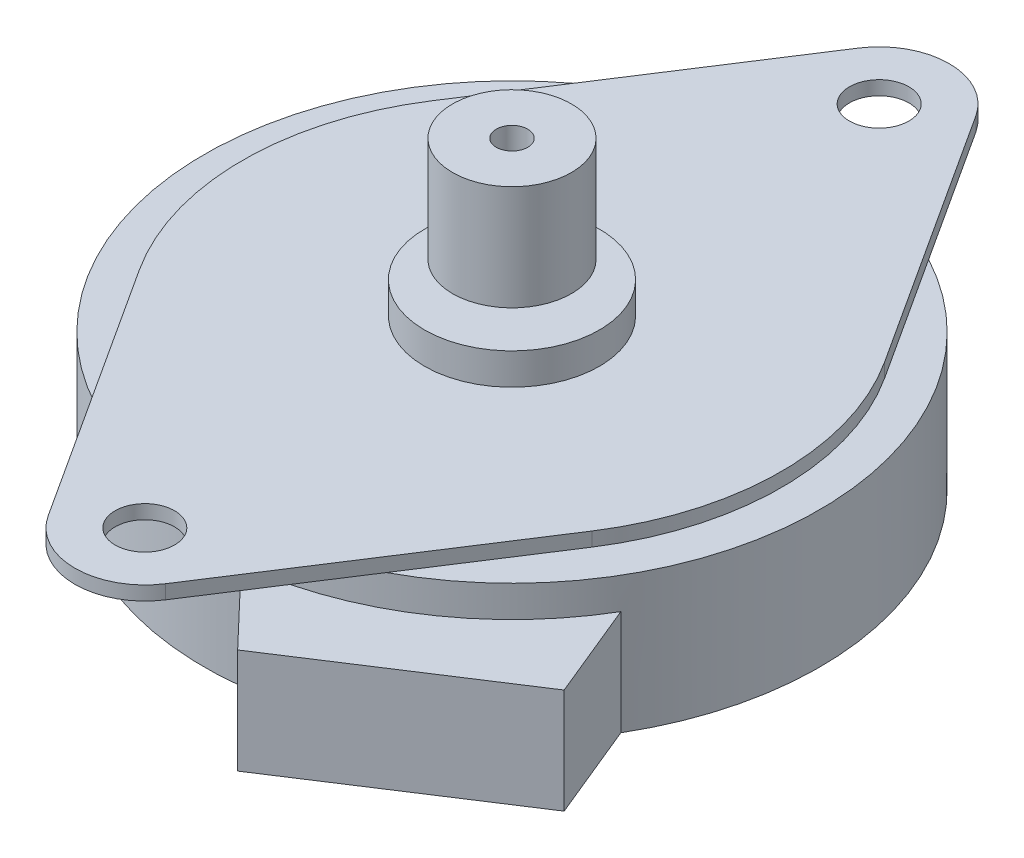
ISO-10303-21;
HEADER;
FILE_DESCRIPTION(('STEP AP214'),'2;1');
FILE_NAME('part.step','',(''),(''),'','','');
FILE_SCHEMA(('AUTOMOTIVE_DESIGN { 1 0 10303 214 1 1 1 1 }'));
ENDSEC;
DATA;
#1=APPLICATION_CONTEXT('core data for automotive mechanical design processes');
#2=APPLICATION_PROTOCOL_DEFINITION('international standard','automotive_design',2000,#1);
#3=PRODUCT_CONTEXT('',#1,'mechanical');
#4=PRODUCT('Part','Part','',(#3));
#5=PRODUCT_RELATED_PRODUCT_CATEGORY('part','',(#4));
#6=PRODUCT_DEFINITION_FORMATION('','',#4);
#7=PRODUCT_DEFINITION_CONTEXT('part definition',#1,'design');
#8=PRODUCT_DEFINITION('design','',#6,#7);
#9=PRODUCT_DEFINITION_SHAPE('','',#8);
#10=(LENGTH_UNIT() NAMED_UNIT(*) SI_UNIT(.MILLI.,.METRE.));
#11=(NAMED_UNIT(*) PLANE_ANGLE_UNIT() SI_UNIT($,.RADIAN.));
#12=(NAMED_UNIT(*) SI_UNIT($,.STERADIAN.) SOLID_ANGLE_UNIT());
#13=UNCERTAINTY_MEASURE_WITH_UNIT(LENGTH_MEASURE(1.E-05),#10,'distance_accuracy_value','');
#14=(GEOMETRIC_REPRESENTATION_CONTEXT(3) GLOBAL_UNCERTAINTY_ASSIGNED_CONTEXT((#13)) GLOBAL_UNIT_ASSIGNED_CONTEXT((#10,
#11,#12)) REPRESENTATION_CONTEXT('',''));
#15=CARTESIAN_POINT('',(0.,0.,0.));
#16=DIRECTION('',(0.,0.,1.));
#17=DIRECTION('',(1.,0.,0.));
#18=AXIS2_PLACEMENT_3D('',#15,#16,#17);
#19=CARTESIAN_POINT('',(0.,15.4,0.));
#20=DIRECTION('',(0.,-1.,0.));
#21=DIRECTION('',(0.,0.,-1.));
#22=AXIS2_PLACEMENT_3D('',#19,#20,#21);
#23=CYLINDRICAL_SURFACE('',#22,0.9);
#24=CARTESIAN_POINT('',(0.,10.4,0.));
#25=DIRECTION('',(0.,1.,0.));
#26=DIRECTION('',(0.,0.,1.));
#27=AXIS2_PLACEMENT_3D('',#24,#25,#26);
#28=CIRCLE('',#27,0.9);
#29=CARTESIAN_POINT('',(0.,10.4,0.9));
#30=VERTEX_POINT('',#29);
#31=EDGE_CURVE('E185',#30,#30,#28,.T.);
#32=ORIENTED_EDGE('',*,*,#31,.T.);
#33=EDGE_LOOP('',(#32));
#34=FACE_BOUND('',#33,.T.);
#35=CARTESIAN_POINT('',(0.,11.4,0.));
#36=DIRECTION('',(0.,1.,0.));
#37=DIRECTION('',(0.,0.,1.));
#38=AXIS2_PLACEMENT_3D('',#35,#36,#37);
#39=CIRCLE('',#38,0.9);
#40=CARTESIAN_POINT('',(0.,11.4,0.9));
#41=VERTEX_POINT('',#40);
#42=EDGE_CURVE('E11',#41,#41,#39,.T.);
#43=ORIENTED_EDGE('',*,*,#42,.F.);
#44=EDGE_LOOP('',(#43));
#45=FACE_BOUND('',#44,.T.);
#46=ADVANCED_FACE('F42',(#34,#45),#23,.T.);
#47=CARTESIAN_POINT('',(0.,7.8,0.));
#48=DIRECTION('',(0.,1.,0.));
#49=DIRECTION('',(0.,0.,1.));
#50=AXIS2_PLACEMENT_3D('',#47,#48,#49);
#51=PLANE('',#50);
#52=DIRECTION('',(0.543434343434261,0.,0.839451674830763));
#53=VECTOR('',#52,1.);
#54=CARTESIAN_POINT('',(-3.35780669932512,7.8,23.173737373737));
#55=LINE('',#54,#53);
#56=CARTESIAN_POINT('',(-12.9377309642099,7.8,8.37547597183833));
#57=VERTEX_POINT('',#56);
#58=CARTESIAN_POINT('',(-8.31928969295883,7.8,15.5096556700859));
#59=VERTEX_POINT('',#58);
#60=EDGE_CURVE('E241',#57,#59,#55,.T.);
#61=ORIENTED_EDGE('',*,*,#60,.F.);
#62=CARTESIAN_POINT('',(0.,7.8,0.));
#63=DIRECTION('',(0.,1.,0.));
#64=DIRECTION('',(0.,0.,1.));
#65=AXIS2_PLACEMENT_3D('',#62,#63,#64);
#66=CIRCLE('',#65,15.4121212121212);
#67=CARTESIAN_POINT('',(-12.9377309642091,7.8,-8.37547597183961));
#68=VERTEX_POINT('',#67);
#69=EDGE_CURVE('E237',#68,#57,#66,.T.);
#70=ORIENTED_EDGE('',*,*,#69,.F.);
#71=DIRECTION('',(-0.543434343434343,0.,0.83945167483071));
#72=VECTOR('',#71,1.);
#73=CARTESIAN_POINT('',(-3.35780669932284,7.8,-23.1737373737374));
#74=LINE('',#73,#72);
#75=CARTESIAN_POINT('',(-8.31928969295731,7.8,-15.5096556700868));
#76=VERTEX_POINT('',#75);
#77=EDGE_CURVE('E188',#76,#68,#74,.T.);
#78=ORIENTED_EDGE('',*,*,#77,.F.);
#79=CARTESIAN_POINT('',(0.,7.8,0.));
#80=DIRECTION('',(0.,1.,0.));
#81=DIRECTION('',(0.,0.,1.));
#82=AXIS2_PLACEMENT_3D('',#79,#80,#81);
#83=CIRCLE('',#82,17.6);
#84=EDGE_CURVE('E277',#76,#59,#83,.T.);
#85=ORIENTED_EDGE('',*,*,#84,.T.);
#86=EDGE_LOOP('',(#61,#70,#78,#85));
#87=FACE_BOUND('',#86,.T.);
#88=ADVANCED_FACE('F310',(#87),#51,.T.);
#89=CARTESIAN_POINT('',(0.,7.8,0.));
#90=DIRECTION('',(0.,-1.,0.));
#91=DIRECTION('',(0.,0.,-1.));
#92=AXIS2_PLACEMENT_3D('',#89,#90,#91);
#93=CYLINDRICAL_SURFACE('',#92,17.6);
#94=CARTESIAN_POINT('',(0.,0.,0.));
#95=DIRECTION('',(0.,1.,0.));
#96=DIRECTION('',(0.,0.,1.));
#97=AXIS2_PLACEMENT_3D('',#94,#95,#96);
#98=CIRCLE('',#97,17.6);
#99=CARTESIAN_POINT('',(15.1619001052058,0.,8.93738133905859));
#100=VERTEX_POINT('',#99);
#101=CARTESIAN_POINT('',(1.99379120909403,0.,17.4867034233025));
#102=VERTEX_POINT('',#101);
#103=EDGE_CURVE('E272',#100,#102,#98,.T.);
#104=ORIENTED_EDGE('',*,*,#103,.T.);
#105=DIRECTION('',(0.,-1.,0.));
#106=VECTOR('',#105,1.);
#107=CARTESIAN_POINT('',(1.99379120909383,6.,17.4867034233023));
#108=LINE('',#107,#106);
#109=CARTESIAN_POINT('',(1.99379120909385,6.,17.4867034233025));
#110=VERTEX_POINT('',#109);
#111=EDGE_CURVE('E62',#110,#102,#108,.T.);
#112=ORIENTED_EDGE('',*,*,#111,.F.);
#113=CARTESIAN_POINT('',(0.,6.,-2.28983498828939E-13));
#114=DIRECTION('',(0.,1.,0.));
#115=DIRECTION('',(0.,0.,1.));
#116=AXIS2_PLACEMENT_3D('',#113,#114,#115);
#117=CIRCLE('',#116,17.6);
#118=CARTESIAN_POINT('',(15.161900105206,6.,8.93738133905871));
#119=VERTEX_POINT('',#118);
#120=EDGE_CURVE('E57',#110,#119,#117,.T.);
#121=ORIENTED_EDGE('',*,*,#120,.T.);
#122=DIRECTION('',(0.,-1.,0.));
#123=VECTOR('',#122,1.);
#124=CARTESIAN_POINT('',(15.1619001052058,6.,8.93738133905859));
#125=LINE('',#124,#123);
#126=EDGE_CURVE('E154',#119,#100,#125,.T.);
#127=ORIENTED_EDGE('',*,*,#126,.T.);
#128=EDGE_LOOP('',(#104,#112,#121,#127));
#129=FACE_BOUND('',#128,.T.);
#130=CARTESIAN_POINT('',(8.31928969295578,7.8,15.5096556700876));
#131=VERTEX_POINT('',#130);
#132=CARTESIAN_POINT('',(8.31928969295731,7.8,-15.5096556700868));
#133=VERTEX_POINT('',#132);
#134=EDGE_CURVE('E273',#131,#133,#83,.T.);
#135=ORIENTED_EDGE('',*,*,#134,.F.);
#136=EDGE_CURVE('E275',#59,#131,#83,.T.);
#137=ORIENTED_EDGE('',*,*,#136,.F.);
#138=ORIENTED_EDGE('',*,*,#84,.F.);
#139=EDGE_CURVE('E274',#133,#76,#83,.T.);
#140=ORIENTED_EDGE('',*,*,#139,.F.);
#141=EDGE_LOOP('',(#135,#137,#138,#140));
#142=FACE_BOUND('',#141,.T.);
#143=ADVANCED_FACE('F44',(#129,#142),#93,.T.);
#144=DIRECTION('',(0.543434343434426,0.,-0.839451674830657));
#145=VECTOR('',#144,1.);
#146=CARTESIAN_POINT('',(3.35780669932056,7.8,23.1737373737377));
#147=LINE('',#146,#145);
#148=CARTESIAN_POINT('',(12.9377309642082,7.8,8.37547597184088));
#149=VERTEX_POINT('',#148);
#150=EDGE_CURVE('E248',#131,#149,#147,.T.);
#151=ORIENTED_EDGE('',*,*,#150,.F.);
#152=ORIENTED_EDGE('',*,*,#134,.T.);
#153=DIRECTION('',(-0.543434343434344,0.,-0.83945167483071));
#154=VECTOR('',#153,1.);
#155=CARTESIAN_POINT('',(3.35780669932284,7.8,-23.1737373737374));
#156=LINE('',#155,#154);
#157=CARTESIAN_POINT('',(12.9377309642091,7.8,-8.37547597183961));
#158=VERTEX_POINT('',#157);
#159=EDGE_CURVE('E229',#158,#133,#156,.T.);
#160=ORIENTED_EDGE('',*,*,#159,.F.);
#161=CARTESIAN_POINT('',(0.,7.8,0.));
#162=DIRECTION('',(0.,1.,0.));
#163=DIRECTION('',(0.,0.,1.));
#164=AXIS2_PLACEMENT_3D('',#161,#162,#163);
#165=CIRCLE('',#164,15.4121212121212);
#166=EDGE_CURVE('E204',#149,#158,#165,.T.);
#167=ORIENTED_EDGE('',*,*,#166,.F.);
#168=EDGE_LOOP('',(#151,#152,#160,#167));
#169=FACE_BOUND('',#168,.T.);
#170=ADVANCED_FACE('F307',(#169),#51,.T.);
#171=CARTESIAN_POINT('',(0.,0.,0.));
#172=DIRECTION('',(0.,1.,0.));
#173=DIRECTION('',(0.,0.,1.));
#174=AXIS2_PLACEMENT_3D('',#171,#172,#173);
#175=PLANE('',#174);
#176=CARTESIAN_POINT('',(0.,0.,0.));
#177=DIRECTION('',(0.,-1.,0.));
#178=DIRECTION('',(0.,0.,-1.));
#179=AXIS2_PLACEMENT_3D('',#176,#177,#178);
#180=CIRCLE('',#179,2.6);
#181=CARTESIAN_POINT('',(0.,0.,-2.6));
#182=VERTEX_POINT('',#181);
#183=EDGE_CURVE('E50',#182,#182,#180,.T.);
#184=ORIENTED_EDGE('',*,*,#183,.F.);
#185=EDGE_LOOP('',(#184));
#186=FACE_BOUND('',#185,.T.);
#187=ORIENTED_EDGE('',*,*,#103,.F.);
#188=DIRECTION('',(0.380101503379585,0.,0.924944780583457));
#189=VECTOR('',#188,1.);
#190=CARTESIAN_POINT('',(17.4235727432113,0.,14.4409699418707));
#191=LINE('',#190,#189);
#192=CARTESIAN_POINT('',(17.4235727432113,0.,14.4409699418707));
#193=VERTEX_POINT('',#192);
#194=EDGE_CURVE('E170',#100,#193,#191,.T.);
#195=ORIENTED_EDGE('',*,*,#194,.T.);
#196=DIRECTION('',(-0.838733050707768,0.,0.544542807913612));
#197=VECTOR('',#196,1.);
#198=CARTESIAN_POINT('',(6.10067655865646,0.,21.7922978487045));
#199=LINE('',#198,#197);
#200=CARTESIAN_POINT('',(6.10067655865646,0.,21.7922978487045));
#201=VERTEX_POINT('',#200);
#202=EDGE_CURVE('E148',#193,#201,#199,.T.);
#203=ORIENTED_EDGE('',*,*,#202,.T.);
#204=DIRECTION('',(-0.690211867687866,0.,-0.723607336683942));
#205=VECTOR('',#204,1.);
#206=CARTESIAN_POINT('',(6.10067655865646,0.,21.7922978487045));
#207=LINE('',#206,#205);
#208=EDGE_CURVE('E165',#201,#102,#207,.T.);
#209=ORIENTED_EDGE('',*,*,#208,.T.);
#210=EDGE_LOOP('',(#187,#195,#203,#209));
#211=FACE_BOUND('',#210,.T.);
#212=ADVANCED_FACE('F315',(#186,#211),#175,.F.);
#213=CARTESIAN_POINT('',(0.,7.8,0.));
#214=DIRECTION('',(0.,1.,0.));
#215=DIRECTION('',(0.,0.,1.));
#216=AXIS2_PLACEMENT_3D('',#213,#214,#215);
#217=PLANE('',#216);
#218=CARTESIAN_POINT('',(0.,7.8,-21.));
#219=DIRECTION('',(0.,1.,0.));
#220=DIRECTION('',(0.,0.,1.));
#221=AXIS2_PLACEMENT_3D('',#218,#219,#220);
#222=CIRCLE('',#221,1.7);
#223=CARTESIAN_POINT('',(0.,7.8,-19.3));
#224=VERTEX_POINT('',#223);
#225=EDGE_CURVE('E198',#224,#224,#222,.T.);
#226=ORIENTED_EDGE('',*,*,#225,.T.);
#227=EDGE_LOOP('',(#226));
#228=FACE_BOUND('',#227,.T.);
#229=CARTESIAN_POINT('',(3.35780669932284,7.8,-23.1737373737374));
#230=VERTEX_POINT('',#229);
#231=EDGE_CURVE('E228',#133,#230,#156,.T.);
#232=ORIENTED_EDGE('',*,*,#231,.F.);
#233=ORIENTED_EDGE('',*,*,#139,.T.);
#234=CARTESIAN_POINT('',(-3.35780669932284,7.8,-23.1737373737374));
#235=VERTEX_POINT('',#234);
#236=EDGE_CURVE('E234',#235,#76,#74,.T.);
#237=ORIENTED_EDGE('',*,*,#236,.F.);
#238=CARTESIAN_POINT('',(0.,7.8,-21.));
#239=DIRECTION('',(0.,1.,0.));
#240=DIRECTION('',(0.,0.,1.));
#241=AXIS2_PLACEMENT_3D('',#238,#239,#240);
#242=CIRCLE('',#241,4.);
#243=EDGE_CURVE('E232',#230,#235,#242,.T.);
#244=ORIENTED_EDGE('',*,*,#243,.F.);
#245=EDGE_LOOP('',(#232,#233,#237,#244));
#246=FACE_BOUND('',#245,.T.);
#247=ADVANCED_FACE('F289',(#228,#246),#217,.F.);
#248=CARTESIAN_POINT('',(-2.06334560000726E-12,7.8,21.));
#249=DIRECTION('',(0.,1.,0.));
#250=DIRECTION('',(0.,0.,1.));
#251=AXIS2_PLACEMENT_3D('',#248,#249,#250);
#252=CIRCLE('',#251,1.7);
#253=CARTESIAN_POINT('',(-2.06334560000726E-12,7.8,22.7));
#254=VERTEX_POINT('',#253);
#255=EDGE_CURVE('E192',#254,#254,#252,.T.);
#256=ORIENTED_EDGE('',*,*,#255,.T.);
#257=EDGE_LOOP('',(#256));
#258=FACE_BOUND('',#257,.T.);
#259=CARTESIAN_POINT('',(-3.35780669932512,7.8,23.173737373737));
#260=VERTEX_POINT('',#259);
#261=EDGE_CURVE('E240',#59,#260,#55,.T.);
#262=ORIENTED_EDGE('',*,*,#261,.F.);
#263=ORIENTED_EDGE('',*,*,#136,.T.);
#264=CARTESIAN_POINT('',(3.35780669932056,7.8,23.1737373737377));
#265=VERTEX_POINT('',#264);
#266=EDGE_CURVE('E211',#265,#131,#147,.T.);
#267=ORIENTED_EDGE('',*,*,#266,.F.);
#268=CARTESIAN_POINT('',(-2.06334560000726E-12,7.8,21.));
#269=DIRECTION('',(0.,1.,0.));
#270=DIRECTION('',(0.,0.,1.));
#271=AXIS2_PLACEMENT_3D('',#268,#269,#270);
#272=CIRCLE('',#271,4.);
#273=EDGE_CURVE('E244',#260,#265,#272,.T.);
#274=ORIENTED_EDGE('',*,*,#273,.F.);
#275=EDGE_LOOP('',(#262,#263,#267,#274));
#276=FACE_BOUND('',#275,.T.);
#277=ADVANCED_FACE('F349',(#258,#276),#217,.F.);
#278=CARTESIAN_POINT('',(0.,8.6,0.));
#279=DIRECTION('',(0.,1.,0.));
#280=DIRECTION('',(0.,0.,1.));
#281=AXIS2_PLACEMENT_3D('',#278,#279,#280);
#282=PLANE('',#281);
#283=CARTESIAN_POINT('',(0.,8.6,0.));
#284=DIRECTION('',(0.,1.,0.));
#285=DIRECTION('',(0.,0.,1.));
#286=AXIS2_PLACEMENT_3D('',#283,#284,#285);
#287=CIRCLE('',#286,5.);
#288=CARTESIAN_POINT('',(0.,8.6,5.));
#289=VERTEX_POINT('',#288);
#290=EDGE_CURVE('E182',#289,#289,#287,.T.);
#291=ORIENTED_EDGE('',*,*,#290,.F.);
#292=EDGE_LOOP('',(#291));
#293=FACE_BOUND('',#292,.T.);
#294=CARTESIAN_POINT('',(0.,8.6,-21.));
#295=DIRECTION('',(0.,1.,0.));
#296=DIRECTION('',(0.,0.,1.));
#297=AXIS2_PLACEMENT_3D('',#294,#295,#296);
#298=CIRCLE('',#297,1.7);
#299=CARTESIAN_POINT('',(0.,8.6,-19.3));
#300=VERTEX_POINT('',#299);
#301=EDGE_CURVE('E201',#300,#300,#298,.T.);
#302=ORIENTED_EDGE('',*,*,#301,.F.);
#303=EDGE_LOOP('',(#302));
#304=FACE_BOUND('',#303,.T.);
#305=CARTESIAN_POINT('',(0.,8.6,0.));
#306=DIRECTION('',(0.,1.,0.));
#307=DIRECTION('',(0.,0.,1.));
#308=AXIS2_PLACEMENT_3D('',#305,#306,#307);
#309=CIRCLE('',#308,15.4121212121212);
#310=CARTESIAN_POINT('',(12.9377309642082,8.6,8.37547597184088));
#311=VERTEX_POINT('',#310);
#312=CARTESIAN_POINT('',(12.9377309642091,8.6,-8.37547597183961));
#313=VERTEX_POINT('',#312);
#314=EDGE_CURVE('E207',#311,#313,#309,.T.);
#315=ORIENTED_EDGE('',*,*,#314,.T.);
#316=DIRECTION('',(-0.543434343434344,0.,-0.83945167483071));
#317=VECTOR('',#316,1.);
#318=CARTESIAN_POINT('',(3.35780669932284,8.6,-23.1737373737374));
#319=LINE('',#318,#317);
#320=CARTESIAN_POINT('',(3.35780669932284,8.6,-23.1737373737374));
#321=VERTEX_POINT('',#320);
#322=EDGE_CURVE('E210',#313,#321,#319,.T.);
#323=ORIENTED_EDGE('',*,*,#322,.T.);
#324=CARTESIAN_POINT('',(0.,8.6,-21.));
#325=DIRECTION('',(0.,1.,0.));
#326=DIRECTION('',(0.,0.,1.));
#327=AXIS2_PLACEMENT_3D('',#324,#325,#326);
#328=CIRCLE('',#327,4.);
#329=CARTESIAN_POINT('',(-3.35780669932284,8.6,-23.1737373737374));
#330=VERTEX_POINT('',#329);
#331=EDGE_CURVE('E213',#321,#330,#328,.T.);
#332=ORIENTED_EDGE('',*,*,#331,.T.);
#333=DIRECTION('',(-0.543434343434343,0.,0.83945167483071));
#334=VECTOR('',#333,1.);
#335=CARTESIAN_POINT('',(-3.35780669932284,8.6,-23.1737373737374));
#336=LINE('',#335,#334);
#337=CARTESIAN_POINT('',(-12.9377309642091,8.6,-8.37547597183961));
#338=VERTEX_POINT('',#337);
#339=EDGE_CURVE('E215',#330,#338,#336,.T.);
#340=ORIENTED_EDGE('',*,*,#339,.T.);
#341=CARTESIAN_POINT('',(0.,8.6,0.));
#342=DIRECTION('',(0.,1.,0.));
#343=DIRECTION('',(0.,0.,1.));
#344=AXIS2_PLACEMENT_3D('',#341,#342,#343);
#345=CIRCLE('',#344,15.4121212121212);
#346=CARTESIAN_POINT('',(-12.9377309642099,8.6,8.37547597183833));
#347=VERTEX_POINT('',#346);
#348=EDGE_CURVE('E217',#338,#347,#345,.T.);
#349=ORIENTED_EDGE('',*,*,#348,.T.);
#350=DIRECTION('',(0.543434343434261,0.,0.839451674830763));
#351=VECTOR('',#350,1.);
#352=CARTESIAN_POINT('',(-3.35780669932512,8.6,23.173737373737));
#353=LINE('',#352,#351);
#354=CARTESIAN_POINT('',(-3.35780669932512,8.6,23.173737373737));
#355=VERTEX_POINT('',#354);
#356=EDGE_CURVE('E219',#347,#355,#353,.T.);
#357=ORIENTED_EDGE('',*,*,#356,.T.);
#358=CARTESIAN_POINT('',(-2.06334560000726E-12,8.6,21.));
#359=DIRECTION('',(0.,1.,0.));
#360=DIRECTION('',(0.,0.,1.));
#361=AXIS2_PLACEMENT_3D('',#358,#359,#360);
#362=CIRCLE('',#361,4.);
#363=CARTESIAN_POINT('',(3.35780669932056,8.6,23.1737373737377));
#364=VERTEX_POINT('',#363);
#365=EDGE_CURVE('E221',#355,#364,#362,.T.);
#366=ORIENTED_EDGE('',*,*,#365,.T.);
#367=DIRECTION('',(0.543434343434426,0.,-0.839451674830657));
#368=VECTOR('',#367,1.);
#369=CARTESIAN_POINT('',(3.35780669932056,8.6,23.1737373737377));
#370=LINE('',#369,#368);
#371=EDGE_CURVE('E223',#364,#311,#370,.T.);
#372=ORIENTED_EDGE('',*,*,#371,.T.);
#373=EDGE_LOOP('',(#315,#323,#332,#340,#349,#357,#366,#372));
#374=FACE_BOUND('',#373,.T.);
#375=CARTESIAN_POINT('',(-2.06334560000726E-12,8.6,21.));
#376=DIRECTION('',(0.,1.,0.));
#377=DIRECTION('',(0.,0.,1.));
#378=AXIS2_PLACEMENT_3D('',#375,#376,#377);
#379=CIRCLE('',#378,1.7);
#380=CARTESIAN_POINT('',(-2.06334560000726E-12,8.6,22.7));
#381=VERTEX_POINT('',#380);
#382=EDGE_CURVE('E195',#381,#381,#379,.T.);
#383=ORIENTED_EDGE('',*,*,#382,.F.);
#384=EDGE_LOOP('',(#383));
#385=FACE_BOUND('',#384,.T.);
#386=ADVANCED_FACE('F345',(#293,#304,#374,#385),#282,.T.);
#387=CARTESIAN_POINT('',(0.,8.6,0.));
#388=DIRECTION('',(0.,-1.,0.));
#389=DIRECTION('',(0.,0.,-1.));
#390=AXIS2_PLACEMENT_3D('',#387,#388,#389);
#391=CYLINDRICAL_SURFACE('',#390,15.4121212121212);
#392=ORIENTED_EDGE('',*,*,#166,.T.);
#393=DIRECTION('',(0.,-1.,0.));
#394=VECTOR('',#393,1.);
#395=CARTESIAN_POINT('',(12.9377309642091,8.6,-8.37547597183961));
#396=LINE('',#395,#394);
#397=EDGE_CURVE('E269',#313,#158,#396,.T.);
#398=ORIENTED_EDGE('',*,*,#397,.F.);
#399=ORIENTED_EDGE('',*,*,#314,.F.);
#400=DIRECTION('',(0.,-1.,0.));
#401=VECTOR('',#400,1.);
#402=CARTESIAN_POINT('',(12.9377309642082,8.6,8.37547597184088));
#403=LINE('',#402,#401);
#404=EDGE_CURVE('E225',#311,#149,#403,.T.);
#405=ORIENTED_EDGE('',*,*,#404,.T.);
#406=EDGE_LOOP('',(#392,#398,#399,#405));
#407=FACE_BOUND('',#406,.T.);
#408=ADVANCED_FACE('F348',(#407),#391,.T.);
#409=CARTESIAN_POINT('',(3.35780669932284,8.6,-23.1737373737374));
#410=DIRECTION('',(-0.83945167483071,0.,0.543434343434344));
#411=DIRECTION('',(0.543434343434344,0.,0.83945167483071));
#412=AXIS2_PLACEMENT_3D('',#409,#410,#411);
#413=PLANE('',#412);
#414=ORIENTED_EDGE('',*,*,#159,.T.);
#415=ORIENTED_EDGE('',*,*,#231,.T.);
#416=DIRECTION('',(0.,-1.,0.));
#417=VECTOR('',#416,1.);
#418=CARTESIAN_POINT('',(3.35780669932284,8.6,-23.1737373737374));
#419=LINE('',#418,#417);
#420=EDGE_CURVE('E266',#321,#230,#419,.T.);
#421=ORIENTED_EDGE('',*,*,#420,.F.);
#422=ORIENTED_EDGE('',*,*,#322,.F.);
#423=ORIENTED_EDGE('',*,*,#397,.T.);
#424=EDGE_LOOP('',(#414,#415,#421,#422,#423));
#425=FACE_BOUND('',#424,.T.);
#426=ADVANCED_FACE('F304',(#425),#413,.F.);
#427=CARTESIAN_POINT('',(0.,8.6,-21.));
#428=DIRECTION('',(0.,-1.,0.));
#429=DIRECTION('',(0.,0.,-1.));
#430=AXIS2_PLACEMENT_3D('',#427,#428,#429);
#431=CYLINDRICAL_SURFACE('',#430,4.);
#432=ORIENTED_EDGE('',*,*,#243,.T.);
#433=DIRECTION('',(0.,-1.,0.));
#434=VECTOR('',#433,1.);
#435=CARTESIAN_POINT('',(-3.35780669932284,8.6,-23.1737373737374));
#436=LINE('',#435,#434);
#437=EDGE_CURVE('E263',#330,#235,#436,.T.);
#438=ORIENTED_EDGE('',*,*,#437,.F.);
#439=ORIENTED_EDGE('',*,*,#331,.F.);
#440=ORIENTED_EDGE('',*,*,#420,.T.);
#441=EDGE_LOOP('',(#432,#438,#439,#440));
#442=FACE_BOUND('',#441,.T.);
#443=ADVANCED_FACE('F301',(#442),#431,.T.);
#444=CARTESIAN_POINT('',(-3.35780669932284,8.6,-23.1737373737374));
#445=DIRECTION('',(0.83945167483071,0.,0.543434343434343));
#446=DIRECTION('',(0.543434343434343,0.,-0.83945167483071));
#447=AXIS2_PLACEMENT_3D('',#444,#445,#446);
#448=PLANE('',#447);
#449=ORIENTED_EDGE('',*,*,#236,.T.);
#450=ORIENTED_EDGE('',*,*,#77,.T.);
#451=DIRECTION('',(0.,-1.,0.));
#452=VECTOR('',#451,1.);
#453=CARTESIAN_POINT('',(-12.9377309642091,8.6,-8.37547597183961));
#454=LINE('',#453,#452);
#455=EDGE_CURVE('E260',#338,#68,#454,.T.);
#456=ORIENTED_EDGE('',*,*,#455,.F.);
#457=ORIENTED_EDGE('',*,*,#339,.F.);
#458=ORIENTED_EDGE('',*,*,#437,.T.);
#459=EDGE_LOOP('',(#449,#450,#456,#457,#458));
#460=FACE_BOUND('',#459,.T.);
#461=ADVANCED_FACE('F295',(#460),#448,.F.);
#462=CARTESIAN_POINT('',(0.,8.6,0.));
#463=DIRECTION('',(0.,-1.,0.));
#464=DIRECTION('',(0.,0.,-1.));
#465=AXIS2_PLACEMENT_3D('',#462,#463,#464);
#466=CYLINDRICAL_SURFACE('',#465,15.4121212121212);
#467=ORIENTED_EDGE('',*,*,#69,.T.);
#468=DIRECTION('',(0.,-1.,0.));
#469=VECTOR('',#468,1.);
#470=CARTESIAN_POINT('',(-12.9377309642099,8.6,8.37547597183833));
#471=LINE('',#470,#469);
#472=EDGE_CURVE('E257',#347,#57,#471,.T.);
#473=ORIENTED_EDGE('',*,*,#472,.F.);
#474=ORIENTED_EDGE('',*,*,#348,.F.);
#475=ORIENTED_EDGE('',*,*,#455,.T.);
#476=EDGE_LOOP('',(#467,#473,#474,#475));
#477=FACE_BOUND('',#476,.T.);
#478=ADVANCED_FACE('F364',(#477),#466,.T.);
#479=CARTESIAN_POINT('',(-3.35780669932512,8.6,23.173737373737));
#480=DIRECTION('',(0.839451674830763,0.,-0.543434343434261));
#481=DIRECTION('',(-0.543434343434261,0.,-0.839451674830763));
#482=AXIS2_PLACEMENT_3D('',#479,#480,#481);
#483=PLANE('',#482);
#484=ORIENTED_EDGE('',*,*,#60,.T.);
#485=ORIENTED_EDGE('',*,*,#261,.T.);
#486=DIRECTION('',(0.,-1.,0.));
#487=VECTOR('',#486,1.);
#488=CARTESIAN_POINT('',(-3.35780669932512,8.6,23.173737373737));
#489=LINE('',#488,#487);
#490=EDGE_CURVE('E254',#355,#260,#489,.T.);
#491=ORIENTED_EDGE('',*,*,#490,.F.);
#492=ORIENTED_EDGE('',*,*,#356,.F.);
#493=ORIENTED_EDGE('',*,*,#472,.T.);
#494=EDGE_LOOP('',(#484,#485,#491,#492,#493));
#495=FACE_BOUND('',#494,.T.);
#496=ADVANCED_FACE('F360',(#495),#483,.F.);
#497=CARTESIAN_POINT('',(-2.06334560000726E-12,8.6,21.));
#498=DIRECTION('',(0.,-1.,0.));
#499=DIRECTION('',(0.,0.,-1.));
#500=AXIS2_PLACEMENT_3D('',#497,#498,#499);
#501=CYLINDRICAL_SURFACE('',#500,4.);
#502=ORIENTED_EDGE('',*,*,#273,.T.);
#503=DIRECTION('',(0.,-1.,0.));
#504=VECTOR('',#503,1.);
#505=CARTESIAN_POINT('',(3.35780669932056,8.6,23.1737373737377));
#506=LINE('',#505,#504);
#507=EDGE_CURVE('E251',#364,#265,#506,.T.);
#508=ORIENTED_EDGE('',*,*,#507,.F.);
#509=ORIENTED_EDGE('',*,*,#365,.F.);
#510=ORIENTED_EDGE('',*,*,#490,.T.);
#511=EDGE_LOOP('',(#502,#508,#509,#510));
#512=FACE_BOUND('',#511,.T.);
#513=ADVANCED_FACE('F356',(#512),#501,.T.);
#514=CARTESIAN_POINT('',(3.35780669932056,8.6,23.1737373737377));
#515=DIRECTION('',(-0.839451674830657,0.,-0.543434343434426));
#516=DIRECTION('',(-0.543434343434426,0.,0.839451674830657));
#517=AXIS2_PLACEMENT_3D('',#514,#515,#516);
#518=PLANE('',#517);
#519=ORIENTED_EDGE('',*,*,#266,.T.);
#520=ORIENTED_EDGE('',*,*,#150,.T.);
#521=ORIENTED_EDGE('',*,*,#404,.F.);
#522=ORIENTED_EDGE('',*,*,#371,.F.);
#523=ORIENTED_EDGE('',*,*,#507,.T.);
#524=EDGE_LOOP('',(#519,#520,#521,#522,#523));
#525=FACE_BOUND('',#524,.T.);
#526=ADVANCED_FACE('F343',(#525),#518,.F.);
#527=CARTESIAN_POINT('',(0.,8.6,-21.));
#528=DIRECTION('',(0.,-1.,0.));
#529=DIRECTION('',(0.,0.,-1.));
#530=AXIS2_PLACEMENT_3D('',#527,#528,#529);
#531=CYLINDRICAL_SURFACE('',#530,1.7);
#532=ORIENTED_EDGE('',*,*,#301,.T.);
#533=EDGE_LOOP('',(#532));
#534=FACE_BOUND('',#533,.T.);
#535=ORIENTED_EDGE('',*,*,#225,.F.);
#536=EDGE_LOOP('',(#535));
#537=FACE_BOUND('',#536,.T.);
#538=ADVANCED_FACE('F339',(#534,#537),#531,.F.);
#539=CARTESIAN_POINT('',(-2.06334560000726E-12,8.6,21.));
#540=DIRECTION('',(0.,-1.,0.));
#541=DIRECTION('',(0.,0.,-1.));
#542=AXIS2_PLACEMENT_3D('',#539,#540,#541);
#543=CYLINDRICAL_SURFACE('',#542,1.7);
#544=ORIENTED_EDGE('',*,*,#382,.T.);
#545=EDGE_LOOP('',(#544));
#546=FACE_BOUND('',#545,.T.);
#547=ORIENTED_EDGE('',*,*,#255,.F.);
#548=EDGE_LOOP('',(#547));
#549=FACE_BOUND('',#548,.T.);
#550=ADVANCED_FACE('F335',(#546,#549),#543,.F.);
#551=CARTESIAN_POINT('',(0.,10.4,0.));
#552=DIRECTION('',(0.,-1.,0.));
#553=DIRECTION('',(0.,0.,-1.));
#554=AXIS2_PLACEMENT_3D('',#551,#552,#553);
#555=CYLINDRICAL_SURFACE('',#554,5.);
#556=CARTESIAN_POINT('',(0.,10.4,0.));
#557=DIRECTION('',(0.,1.,0.));
#558=DIRECTION('',(0.,0.,1.));
#559=AXIS2_PLACEMENT_3D('',#556,#557,#558);
#560=CIRCLE('',#559,5.);
#561=CARTESIAN_POINT('',(0.,10.4,5.));
#562=VERTEX_POINT('',#561);
#563=EDGE_CURVE('E189',#562,#562,#560,.T.);
#564=ORIENTED_EDGE('',*,*,#563,.F.);
#565=EDGE_LOOP('',(#564));
#566=FACE_BOUND('',#565,.T.);
#567=ORIENTED_EDGE('',*,*,#290,.T.);
#568=EDGE_LOOP('',(#567));
#569=FACE_BOUND('',#568,.T.);
#570=ADVANCED_FACE('F331',(#566,#569),#555,.T.);
#571=CARTESIAN_POINT('',(0.,10.4,0.));
#572=DIRECTION('',(0.,1.,0.));
#573=DIRECTION('',(0.,0.,1.));
#574=AXIS2_PLACEMENT_3D('',#571,#572,#573);
#575=PLANE('',#574);
#576=ORIENTED_EDGE('',*,*,#31,.F.);
#577=EDGE_LOOP('',(#576));
#578=FACE_BOUND('',#577,.T.);
#579=ORIENTED_EDGE('',*,*,#563,.T.);
#580=EDGE_LOOP('',(#579));
#581=FACE_BOUND('',#580,.T.);
#582=ADVANCED_FACE('F327',(#578,#581),#575,.T.);
#583=CARTESIAN_POINT('',(0.,-0.5,0.));
#584=DIRECTION('',(0.,1.,0.));
#585=DIRECTION('',(0.,0.,1.));
#586=AXIS2_PLACEMENT_3D('',#583,#584,#585);
#587=CYLINDRICAL_SURFACE('',#586,2.6);
#588=CARTESIAN_POINT('',(0.,-0.5,0.));
#589=DIRECTION('',(0.,-1.,0.));
#590=DIRECTION('',(0.,0.,-1.));
#591=AXIS2_PLACEMENT_3D('',#588,#589,#590);
#592=CIRCLE('',#591,2.6);
#593=CARTESIAN_POINT('',(0.,-0.5,-2.6));
#594=VERTEX_POINT('',#593);
#595=EDGE_CURVE('E177',#594,#594,#592,.T.);
#596=ORIENTED_EDGE('',*,*,#595,.F.);
#597=EDGE_LOOP('',(#596));
#598=FACE_BOUND('',#597,.T.);
#599=ORIENTED_EDGE('',*,*,#183,.T.);
#600=EDGE_LOOP('',(#599));
#601=FACE_BOUND('',#600,.T.);
#602=ADVANCED_FACE('F330',(#598,#601),#587,.T.);
#603=CARTESIAN_POINT('',(0.,-0.5,0.));
#604=DIRECTION('',(0.,-1.,0.));
#605=DIRECTION('',(0.,0.,-1.));
#606=AXIS2_PLACEMENT_3D('',#603,#604,#605);
#607=PLANE('',#606);
#608=ORIENTED_EDGE('',*,*,#595,.T.);
#609=EDGE_LOOP('',(#608));
#610=FACE_BOUND('',#609,.T.);
#611=ADVANCED_FACE('F387',(#610),#607,.T.);
#612=CARTESIAN_POINT('',(6.10067655865646,6.,21.7922978487045));
#613=DIRECTION('',(-0.723607336683942,0.,0.690211867687866));
#614=DIRECTION('',(0.690211867687866,0.,0.723607336683942));
#615=AXIS2_PLACEMENT_3D('',#612,#613,#614);
#616=PLANE('',#615);
#617=ORIENTED_EDGE('',*,*,#208,.F.);
#618=DIRECTION('',(0.,-1.,0.));
#619=VECTOR('',#618,1.);
#620=CARTESIAN_POINT('',(6.10067655865646,6.,21.7922978487045));
#621=LINE('',#620,#619);
#622=CARTESIAN_POINT('',(6.10067655865646,6.,21.7922978487045));
#623=VERTEX_POINT('',#622);
#624=EDGE_CURVE('E153',#623,#201,#621,.T.);
#625=ORIENTED_EDGE('',*,*,#624,.F.);
#626=DIRECTION('',(-0.690211867687866,0.,-0.723607336683942));
#627=VECTOR('',#626,1.);
#628=CARTESIAN_POINT('',(6.10067655865646,6.,21.7922978487045));
#629=LINE('',#628,#627);
#630=EDGE_CURVE('E161',#623,#110,#629,.T.);
#631=ORIENTED_EDGE('',*,*,#630,.T.);
#632=ORIENTED_EDGE('',*,*,#111,.T.);
#633=EDGE_LOOP('',(#617,#625,#631,#632));
#634=FACE_BOUND('',#633,.T.);
#635=ADVANCED_FACE('F385',(#634),#616,.T.);
#636=CARTESIAN_POINT('',(6.10067655865646,6.,21.7922978487045));
#637=DIRECTION('',(0.544542807913611,0.,0.838733050707768));
#638=DIRECTION('',(0.838733050707768,0.,-0.544542807913612));
#639=AXIS2_PLACEMENT_3D('',#636,#637,#638);
#640=PLANE('',#639);
#641=ORIENTED_EDGE('',*,*,#202,.F.);
#642=DIRECTION('',(0.,-1.,0.));
#643=VECTOR('',#642,1.);
#644=CARTESIAN_POINT('',(17.4235727432113,6.,14.4409699418707));
#645=LINE('',#644,#643);
#646=CARTESIAN_POINT('',(17.4235727432113,6.,14.4409699418707));
#647=VERTEX_POINT('',#646);
#648=EDGE_CURVE('E142',#647,#193,#645,.T.);
#649=ORIENTED_EDGE('',*,*,#648,.F.);
#650=DIRECTION('',(-0.838733050707768,0.,0.544542807913612));
#651=VECTOR('',#650,1.);
#652=CARTESIAN_POINT('',(6.10067655865646,6.,21.7922978487045));
#653=LINE('',#652,#651);
#654=EDGE_CURVE('E145',#647,#623,#653,.T.);
#655=ORIENTED_EDGE('',*,*,#654,.T.);
#656=ORIENTED_EDGE('',*,*,#624,.T.);
#657=EDGE_LOOP('',(#641,#649,#655,#656));
#658=FACE_BOUND('',#657,.T.);
#659=ADVANCED_FACE('F144',(#658),#640,.T.);
#660=CARTESIAN_POINT('',(17.4235727432113,6.,14.4409699418707));
#661=DIRECTION('',(0.924944780583457,0.,-0.380101503379585));
#662=DIRECTION('',(-0.380101503379585,0.,-0.924944780583457));
#663=AXIS2_PLACEMENT_3D('',#660,#661,#662);
#664=PLANE('',#663);
#665=ORIENTED_EDGE('',*,*,#194,.F.);
#666=ORIENTED_EDGE('',*,*,#126,.F.);
#667=DIRECTION('',(0.380101503379585,0.,0.924944780583457));
#668=VECTOR('',#667,1.);
#669=CARTESIAN_POINT('',(17.4235727432113,6.,14.4409699418707));
#670=LINE('',#669,#668);
#671=EDGE_CURVE('E159',#119,#647,#670,.T.);
#672=ORIENTED_EDGE('',*,*,#671,.T.);
#673=ORIENTED_EDGE('',*,*,#648,.T.);
#674=EDGE_LOOP('',(#665,#666,#672,#673));
#675=FACE_BOUND('',#674,.T.);
#676=ADVANCED_FACE('F163',(#675),#664,.T.);
#677=CARTESIAN_POINT('',(0.,6.,-2.28983498828939E-13));
#678=DIRECTION('',(0.,1.,0.));
#679=DIRECTION('',(0.,0.,1.));
#680=AXIS2_PLACEMENT_3D('',#677,#678,#679);
#681=PLANE('',#680);
#682=ORIENTED_EDGE('',*,*,#120,.F.);
#683=ORIENTED_EDGE('',*,*,#630,.F.);
#684=ORIENTED_EDGE('',*,*,#654,.F.);
#685=ORIENTED_EDGE('',*,*,#671,.F.);
#686=EDGE_LOOP('',(#682,#683,#684,#685));
#687=FACE_BOUND('',#686,.T.);
#688=ADVANCED_FACE('F158',(#687),#681,.T.);
#689=CARTESIAN_POINT('',(0.,17.4,0.));
#690=DIRECTION('',(0.,1.,0.));
#691=DIRECTION('',(0.,0.,1.));
#692=AXIS2_PLACEMENT_3D('',#689,#690,#691);
#693=PLANE('',#692);
#694=CARTESIAN_POINT('',(0.,17.4,0.));
#695=DIRECTION('',(0.,1.,0.));
#696=DIRECTION('',(0.,0.,1.));
#697=AXIS2_PLACEMENT_3D('',#694,#695,#696);
#698=CIRCLE('',#697,3.4);
#699=CARTESIAN_POINT('',(0.,17.4,3.4));
#700=VERTEX_POINT('',#699);
#701=EDGE_CURVE('E623',#700,#700,#698,.T.);
#702=ORIENTED_EDGE('',*,*,#701,.T.);
#703=EDGE_LOOP('',(#702));
#704=FACE_BOUND('',#703,.T.);
#705=CARTESIAN_POINT('',(0.,17.4,0.));
#706=DIRECTION('',(0.,1.,0.));
#707=DIRECTION('',(0.,0.,1.));
#708=AXIS2_PLACEMENT_3D('',#705,#706,#707);
#709=CIRCLE('',#708,0.9);
#710=CARTESIAN_POINT('',(0.,17.4,0.9));
#711=VERTEX_POINT('',#710);
#712=EDGE_CURVE('E629',#711,#711,#709,.T.);
#713=ORIENTED_EDGE('',*,*,#712,.F.);
#714=EDGE_LOOP('',(#713));
#715=FACE_BOUND('',#714,.T.);
#716=ADVANCED_FACE('F447',(#704,#715),#693,.T.);
#717=CARTESIAN_POINT('',(0.,11.4,0.));
#718=DIRECTION('',(0.,1.,0.));
#719=DIRECTION('',(0.,0.,1.));
#720=AXIS2_PLACEMENT_3D('',#717,#718,#719);
#721=PLANE('',#720);
#722=CARTESIAN_POINT('',(0.,11.4,0.));
#723=DIRECTION('',(0.,1.,0.));
#724=DIRECTION('',(0.,0.,1.));
#725=AXIS2_PLACEMENT_3D('',#722,#723,#724);
#726=CIRCLE('',#725,3.4);
#727=CARTESIAN_POINT('',(0.,11.4,3.4));
#728=VERTEX_POINT('',#727);
#729=EDGE_CURVE('E625',#728,#728,#726,.T.);
#730=ORIENTED_EDGE('',*,*,#729,.F.);
#731=EDGE_LOOP('',(#730));
#732=FACE_BOUND('',#731,.T.);
#733=ORIENTED_EDGE('',*,*,#42,.T.);
#734=EDGE_LOOP('',(#733));
#735=FACE_BOUND('',#734,.T.);
#736=ADVANCED_FACE('F460',(#732,#735),#721,.F.);
#737=CARTESIAN_POINT('',(0.,17.4,0.));
#738=DIRECTION('',(0.,-1.,0.));
#739=DIRECTION('',(0.,0.,-1.));
#740=AXIS2_PLACEMENT_3D('',#737,#738,#739);
#741=CYLINDRICAL_SURFACE('',#740,3.4);
#742=ORIENTED_EDGE('',*,*,#701,.F.);
#743=EDGE_LOOP('',(#742));
#744=FACE_BOUND('',#743,.T.);
#745=ORIENTED_EDGE('',*,*,#729,.T.);
#746=EDGE_LOOP('',(#745));
#747=FACE_BOUND('',#746,.T.);
#748=ADVANCED_FACE('F470',(#744,#747),#741,.T.);
#749=CARTESIAN_POINT('',(0.,17.4,0.));
#750=DIRECTION('',(0.,-1.,0.));
#751=DIRECTION('',(0.,0.,-1.));
#752=AXIS2_PLACEMENT_3D('',#749,#750,#751);
#753=CYLINDRICAL_SURFACE('',#752,0.9);
#754=CARTESIAN_POINT('',(0.,15.4,0.));
#755=DIRECTION('',(0.,1.,0.));
#756=DIRECTION('',(0.,0.,1.));
#757=AXIS2_PLACEMENT_3D('',#754,#755,#756);
#758=CIRCLE('',#757,0.9);
#759=CARTESIAN_POINT('',(0.,15.4,0.9));
#760=VERTEX_POINT('',#759);
#761=EDGE_CURVE('E172',#760,#760,#758,.F.);
#762=ORIENTED_EDGE('',*,*,#761,.T.);
#763=EDGE_LOOP('',(#762));
#764=FACE_BOUND('',#763,.T.);
#765=ORIENTED_EDGE('',*,*,#712,.T.);
#766=EDGE_LOOP('',(#765));
#767=FACE_BOUND('',#766,.T.);
#768=ADVANCED_FACE('F480',(#764,#767),#753,.F.);
#769=CARTESIAN_POINT('',(0.,15.4,0.));
#770=DIRECTION('',(0.,1.,0.));
#771=DIRECTION('',(0.,0.,1.));
#772=AXIS2_PLACEMENT_3D('',#769,#770,#771);
#773=PLANE('',#772);
#774=ORIENTED_EDGE('',*,*,#761,.F.);
#775=EDGE_LOOP('',(#774));
#776=FACE_BOUND('',#775,.T.);
#777=ADVANCED_FACE('F325',(#776),#773,.T.);
#778=CLOSED_SHELL('',(#46,#88,#143,#170,#212,#247,#277,#386,#408,#426,#443,#461,#478,#496,#513,
#526,#538,#550,#570,#582,#602,#611,#635,#659,#676,#688,#716,#736,#748,#768,#777));
#779=MANIFOLD_SOLID_BREP('B2',#778);
#780=ADVANCED_BREP_SHAPE_REPRESENTATION('',(#18,#779),#14);
#781=SHAPE_DEFINITION_REPRESENTATION(#9,#780);
ENDSEC;
END-ISO-10303-21;
